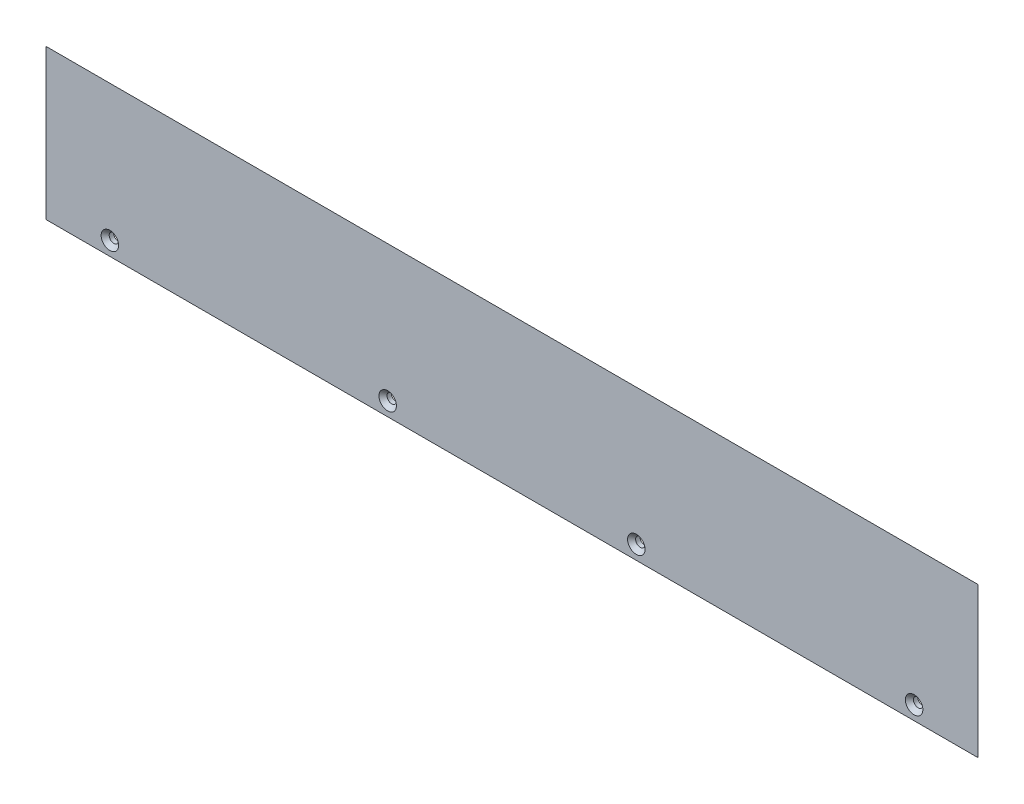
ISO-10303-21;
HEADER;
FILE_DESCRIPTION(('STEP AP214'),'2;1');
FILE_NAME('part.step','',(''),(''),'','','');
FILE_SCHEMA(('AUTOMOTIVE_DESIGN { 1 0 10303 214 1 1 1 1 }'));
ENDSEC;
DATA;
#1=APPLICATION_CONTEXT('core data for automotive mechanical design processes');
#2=APPLICATION_PROTOCOL_DEFINITION('international standard','automotive_design',2000,#1);
#3=PRODUCT_CONTEXT('',#1,'mechanical');
#4=PRODUCT('Part','Part','',(#3));
#5=PRODUCT_RELATED_PRODUCT_CATEGORY('part','',(#4));
#6=PRODUCT_DEFINITION_FORMATION('','',#4);
#7=PRODUCT_DEFINITION_CONTEXT('part definition',#1,'design');
#8=PRODUCT_DEFINITION('design','',#6,#7);
#9=PRODUCT_DEFINITION_SHAPE('','',#8);
#10=(LENGTH_UNIT() NAMED_UNIT(*) SI_UNIT(.MILLI.,.METRE.));
#11=(NAMED_UNIT(*) PLANE_ANGLE_UNIT() SI_UNIT($,.RADIAN.));
#12=(NAMED_UNIT(*) SI_UNIT($,.STERADIAN.) SOLID_ANGLE_UNIT());
#13=UNCERTAINTY_MEASURE_WITH_UNIT(LENGTH_MEASURE(1.E-05),#10,'distance_accuracy_value','');
#14=(GEOMETRIC_REPRESENTATION_CONTEXT(3) GLOBAL_UNCERTAINTY_ASSIGNED_CONTEXT((#13)) GLOBAL_UNIT_ASSIGNED_CONTEXT((#10,
#11,#12)) REPRESENTATION_CONTEXT('',''));
#15=CARTESIAN_POINT('',(0.,0.,0.));
#16=DIRECTION('',(0.,0.,1.));
#17=DIRECTION('',(1.,0.,0.));
#18=AXIS2_PLACEMENT_3D('',#15,#16,#17);
#19=CARTESIAN_POINT('',(0.,0.,3.));
#20=DIRECTION('',(0.,1.,0.));
#21=DIRECTION('',(0.,0.,1.));
#22=AXIS2_PLACEMENT_3D('',#19,#20,#21);
#23=PLANE('',#22);
#24=DIRECTION('',(1.,0.,0.));
#25=VECTOR('',#24,1.);
#26=CARTESIAN_POINT('',(0.,0.,3.));
#27=LINE('',#26,#25);
#28=CARTESIAN_POINT('',(0.,0.,3.));
#29=VERTEX_POINT('',#28);
#30=CARTESIAN_POINT('',(335.5,0.,3.));
#31=VERTEX_POINT('',#30);
#32=EDGE_CURVE('E82',#29,#31,#27,.T.);
#33=ORIENTED_EDGE('',*,*,#32,.F.);
#34=DIRECTION('',(0.707106781186548,0.,-0.707106781186548));
#35=VECTOR('',#34,1.);
#36=CARTESIAN_POINT('',(0.,0.,3.));
#37=LINE('',#36,#35);
#38=CARTESIAN_POINT('',(3.,0.,0.));
#39=VERTEX_POINT('',#38);
#40=EDGE_CURVE('E70',#29,#39,#37,.T.);
#41=ORIENTED_EDGE('',*,*,#40,.T.);
#42=DIRECTION('',(1.,0.,0.));
#43=VECTOR('',#42,1.);
#44=CARTESIAN_POINT('',(0.,0.,0.));
#45=LINE('',#44,#43);
#46=CARTESIAN_POINT('',(332.5,0.,0.));
#47=VERTEX_POINT('',#46);
#48=EDGE_CURVE('E92',#39,#47,#45,.T.);
#49=ORIENTED_EDGE('',*,*,#48,.T.);
#50=DIRECTION('',(0.707106781186548,0.,0.707106781186548));
#51=VECTOR('',#50,1.);
#52=CARTESIAN_POINT('',(335.5,0.,3.));
#53=LINE('',#52,#51);
#54=EDGE_CURVE('E79',#47,#31,#53,.T.);
#55=ORIENTED_EDGE('',*,*,#54,.T.);
#56=EDGE_LOOP('',(#33,#41,#49,#55));
#57=FACE_BOUND('',#56,.T.);
#58=ADVANCED_FACE('F32',(#57),#23,.F.);
#59=CARTESIAN_POINT('',(0.,0.,3.));
#60=DIRECTION('',(0.,0.,-1.));
#61=DIRECTION('',(-1.,0.,0.));
#62=AXIS2_PLACEMENT_3D('',#59,#60,#61);
#63=PLANE('',#62);
#64=CARTESIAN_POINT('',(23.,5.,3.));
#65=DIRECTION('',(0.,0.,1.));
#66=DIRECTION('',(1.,0.,0.));
#67=AXIS2_PLACEMENT_3D('',#64,#65,#66);
#68=CIRCLE('',#67,3.15);
#69=CARTESIAN_POINT('',(26.15,5.,3.));
#70=VERTEX_POINT('',#69);
#71=EDGE_CURVE('E140',#70,#70,#68,.T.);
#72=ORIENTED_EDGE('',*,*,#71,.F.);
#73=EDGE_LOOP('',(#72));
#74=FACE_BOUND('',#73,.T.);
#75=CARTESIAN_POINT('',(123.,5.,3.));
#76=DIRECTION('',(0.,0.,1.));
#77=DIRECTION('',(1.,0.,0.));
#78=AXIS2_PLACEMENT_3D('',#75,#76,#77);
#79=CIRCLE('',#78,3.14999999999999);
#80=CARTESIAN_POINT('',(126.15,5.,3.));
#81=VERTEX_POINT('',#80);
#82=EDGE_CURVE('E131',#81,#81,#79,.T.);
#83=ORIENTED_EDGE('',*,*,#82,.F.);
#84=EDGE_LOOP('',(#83));
#85=FACE_BOUND('',#84,.T.);
#86=CARTESIAN_POINT('',(212.5,5.,3.));
#87=DIRECTION('',(0.,0.,1.));
#88=DIRECTION('',(1.,0.,0.));
#89=AXIS2_PLACEMENT_3D('',#86,#87,#88);
#90=CIRCLE('',#89,3.15000000000001);
#91=CARTESIAN_POINT('',(215.65,5.,3.));
#92=VERTEX_POINT('',#91);
#93=EDGE_CURVE('E122',#92,#92,#90,.T.);
#94=ORIENTED_EDGE('',*,*,#93,.F.);
#95=EDGE_LOOP('',(#94));
#96=FACE_BOUND('',#95,.T.);
#97=CARTESIAN_POINT('',(312.5,5.,3.));
#98=DIRECTION('',(0.,0.,1.));
#99=DIRECTION('',(1.,0.,0.));
#100=AXIS2_PLACEMENT_3D('',#97,#98,#99);
#101=CIRCLE('',#100,3.14999999999999);
#102=CARTESIAN_POINT('',(315.65,5.,3.));
#103=VERTEX_POINT('',#102);
#104=EDGE_CURVE('E110',#103,#103,#101,.T.);
#105=ORIENTED_EDGE('',*,*,#104,.F.);
#106=EDGE_LOOP('',(#105));
#107=FACE_BOUND('',#106,.T.);
#108=DIRECTION('',(0.,-1.,0.));
#109=VECTOR('',#108,1.);
#110=CARTESIAN_POINT('',(0.,0.,3.));
#111=LINE('',#110,#109);
#112=CARTESIAN_POINT('',(0.,54.,3.));
#113=VERTEX_POINT('',#112);
#114=EDGE_CURVE('E75',#113,#29,#111,.T.);
#115=ORIENTED_EDGE('',*,*,#114,.T.);
#116=ORIENTED_EDGE('',*,*,#32,.T.);
#117=DIRECTION('',(0.,1.,0.));
#118=VECTOR('',#117,1.);
#119=CARTESIAN_POINT('',(335.5,0.,3.));
#120=LINE('',#119,#118);
#121=CARTESIAN_POINT('',(335.5,54.,3.));
#122=VERTEX_POINT('',#121);
#123=EDGE_CURVE('E86',#31,#122,#120,.T.);
#124=ORIENTED_EDGE('',*,*,#123,.T.);
#125=DIRECTION('',(-1.,0.,0.));
#126=VECTOR('',#125,1.);
#127=CARTESIAN_POINT('',(0.,54.,3.));
#128=LINE('',#127,#126);
#129=EDGE_CURVE('E90',#122,#113,#128,.T.);
#130=ORIENTED_EDGE('',*,*,#129,.T.);
#131=EDGE_LOOP('',(#115,#116,#124,#130));
#132=FACE_BOUND('',#131,.T.);
#133=ADVANCED_FACE('F88',(#74,#85,#96,#107,#132),#63,.F.);
#134=CARTESIAN_POINT('',(0.,0.,0.));
#135=DIRECTION('',(0.,0.,-1.));
#136=DIRECTION('',(-1.,0.,0.));
#137=AXIS2_PLACEMENT_3D('',#134,#135,#136);
#138=PLANE('',#137);
#139=CARTESIAN_POINT('',(23.,5.,0.));
#140=DIRECTION('',(0.,0.,1.));
#141=DIRECTION('',(1.,0.,0.));
#142=AXIS2_PLACEMENT_3D('',#139,#140,#141);
#143=CIRCLE('',#142,1.69999999999999);
#144=CARTESIAN_POINT('',(24.7,5.,0.));
#145=VERTEX_POINT('',#144);
#146=EDGE_CURVE('E134',#145,#145,#143,.T.);
#147=ORIENTED_EDGE('',*,*,#146,.T.);
#148=EDGE_LOOP('',(#147));
#149=FACE_BOUND('',#148,.T.);
#150=CARTESIAN_POINT('',(123.,5.,0.));
#151=DIRECTION('',(0.,0.,1.));
#152=DIRECTION('',(1.,0.,0.));
#153=AXIS2_PLACEMENT_3D('',#150,#151,#152);
#154=CIRCLE('',#153,1.69999999999999);
#155=CARTESIAN_POINT('',(124.7,5.,0.));
#156=VERTEX_POINT('',#155);
#157=EDGE_CURVE('E125',#156,#156,#154,.T.);
#158=ORIENTED_EDGE('',*,*,#157,.T.);
#159=EDGE_LOOP('',(#158));
#160=FACE_BOUND('',#159,.T.);
#161=CARTESIAN_POINT('',(212.5,5.,0.));
#162=DIRECTION('',(0.,0.,1.));
#163=DIRECTION('',(1.,0.,0.));
#164=AXIS2_PLACEMENT_3D('',#161,#162,#163);
#165=CIRCLE('',#164,1.69999999999998);
#166=CARTESIAN_POINT('',(214.2,5.,0.));
#167=VERTEX_POINT('',#166);
#168=EDGE_CURVE('E114',#167,#167,#165,.T.);
#169=ORIENTED_EDGE('',*,*,#168,.T.);
#170=EDGE_LOOP('',(#169));
#171=FACE_BOUND('',#170,.T.);
#172=CARTESIAN_POINT('',(312.5,5.,0.));
#173=DIRECTION('',(0.,0.,1.));
#174=DIRECTION('',(1.,0.,0.));
#175=AXIS2_PLACEMENT_3D('',#172,#173,#174);
#176=CIRCLE('',#175,1.69999999999998);
#177=CARTESIAN_POINT('',(314.2,5.,0.));
#178=VERTEX_POINT('',#177);
#179=EDGE_CURVE('E96',#178,#178,#176,.T.);
#180=ORIENTED_EDGE('',*,*,#179,.T.);
#181=EDGE_LOOP('',(#180));
#182=FACE_BOUND('',#181,.T.);
#183=ORIENTED_EDGE('',*,*,#48,.F.);
#184=DIRECTION('',(0.,1.,0.));
#185=VECTOR('',#184,1.);
#186=CARTESIAN_POINT('',(3.,54.,0.));
#187=LINE('',#186,#185);
#188=CARTESIAN_POINT('',(3.,51.,0.));
#189=VERTEX_POINT('',#188);
#190=EDGE_CURVE('E11',#39,#189,#187,.T.);
#191=ORIENTED_EDGE('',*,*,#190,.T.);
#192=DIRECTION('',(1.,0.,0.));
#193=VECTOR('',#192,1.);
#194=CARTESIAN_POINT('',(335.5,51.,0.));
#195=LINE('',#194,#193);
#196=CARTESIAN_POINT('',(332.5,51.,0.));
#197=VERTEX_POINT('',#196);
#198=EDGE_CURVE('E41',#189,#197,#195,.T.);
#199=ORIENTED_EDGE('',*,*,#198,.T.);
#200=DIRECTION('',(0.,-1.,0.));
#201=VECTOR('',#200,1.);
#202=CARTESIAN_POINT('',(332.5,0.,0.));
#203=LINE('',#202,#201);
#204=EDGE_CURVE('E78',#197,#47,#203,.T.);
#205=ORIENTED_EDGE('',*,*,#204,.T.);
#206=EDGE_LOOP('',(#183,#191,#199,#205));
#207=FACE_BOUND('',#206,.T.);
#208=ADVANCED_FACE('F148',(#149,#160,#171,#182,#207),#138,.T.);
#209=CARTESIAN_POINT('',(335.5,0.,3.));
#210=DIRECTION('',(0.707106781186547,0.,-0.707106781186547));
#211=DIRECTION('',(0.,-1.,0.));
#212=AXIS2_PLACEMENT_3D('',#209,#210,#211);
#213=PLANE('',#212);
#214=ORIENTED_EDGE('',*,*,#54,.F.);
#215=ORIENTED_EDGE('',*,*,#204,.F.);
#216=DIRECTION('',(0.577350269189626,0.577350269189626,0.577350269189626));
#217=VECTOR('',#216,1.);
#218=CARTESIAN_POINT('',(317.5,36.,-15.));
#219=LINE('',#218,#217);
#220=EDGE_CURVE('E36',#122,#197,#219,.F.);
#221=ORIENTED_EDGE('',*,*,#220,.F.);
#222=ORIENTED_EDGE('',*,*,#123,.F.);
#223=EDGE_LOOP('',(#214,#215,#221,#222));
#224=FACE_BOUND('',#223,.T.);
#225=ADVANCED_FACE('F34',(#224),#213,.T.);
#226=CARTESIAN_POINT('',(0.,54.,3.));
#227=DIRECTION('',(0.,0.707106781186547,-0.707106781186547));
#228=DIRECTION('',(1.,0.,0.));
#229=AXIS2_PLACEMENT_3D('',#226,#227,#228);
#230=PLANE('',#229);
#231=ORIENTED_EDGE('',*,*,#220,.T.);
#232=ORIENTED_EDGE('',*,*,#198,.F.);
#233=DIRECTION('',(-0.577350269189626,0.577350269189626,0.577350269189626));
#234=VECTOR('',#233,1.);
#235=CARTESIAN_POINT('',(0.,54.,3.));
#236=LINE('',#235,#234);
#237=EDGE_CURVE('E103',#113,#189,#236,.F.);
#238=ORIENTED_EDGE('',*,*,#237,.F.);
#239=ORIENTED_EDGE('',*,*,#129,.F.);
#240=EDGE_LOOP('',(#231,#232,#238,#239));
#241=FACE_BOUND('',#240,.T.);
#242=ADVANCED_FACE('F178',(#241),#230,.T.);
#243=CARTESIAN_POINT('',(0.,0.,3.));
#244=DIRECTION('',(-0.707106781186547,0.,-0.707106781186547));
#245=DIRECTION('',(0.,1.,0.));
#246=AXIS2_PLACEMENT_3D('',#243,#244,#245);
#247=PLANE('',#246);
#248=ORIENTED_EDGE('',*,*,#237,.T.);
#249=ORIENTED_EDGE('',*,*,#190,.F.);
#250=ORIENTED_EDGE('',*,*,#40,.F.);
#251=ORIENTED_EDGE('',*,*,#114,.F.);
#252=EDGE_LOOP('',(#248,#249,#250,#251));
#253=FACE_BOUND('',#252,.T.);
#254=ADVANCED_FACE('F73',(#253),#247,.T.);
#255=CARTESIAN_POINT('',(312.5,5.,3.));
#256=DIRECTION('',(0.,0.,1.));
#257=DIRECTION('',(1.,0.,0.));
#258=AXIS2_PLACEMENT_3D('',#255,#256,#257);
#259=CYLINDRICAL_SURFACE('',#258,1.69999999999998);
#260=ORIENTED_EDGE('',*,*,#179,.F.);
#261=EDGE_LOOP('',(#260));
#262=FACE_BOUND('',#261,.T.);
#263=CARTESIAN_POINT('',(312.5,5.,1.55));
#264=DIRECTION('',(0.,0.,1.));
#265=DIRECTION('',(1.,0.,0.));
#266=AXIS2_PLACEMENT_3D('',#263,#264,#265);
#267=CIRCLE('',#266,1.69999999999998);
#268=CARTESIAN_POINT('',(314.2,5.,1.55));
#269=VERTEX_POINT('',#268);
#270=EDGE_CURVE('E106',#269,#269,#267,.T.);
#271=ORIENTED_EDGE('',*,*,#270,.T.);
#272=EDGE_LOOP('',(#271));
#273=FACE_BOUND('',#272,.T.);
#274=ADVANCED_FACE('F159',(#262,#273),#259,.F.);
#275=CARTESIAN_POINT('',(312.5,5.,3.));
#276=DIRECTION('',(0.,0.,1.));
#277=DIRECTION('',(1.,0.,0.));
#278=AXIS2_PLACEMENT_3D('',#275,#276,#277);
#279=CONICAL_SURFACE('',#278,3.14999999999999,0.78539816339745);
#280=ORIENTED_EDGE('',*,*,#270,.F.);
#281=EDGE_LOOP('',(#280));
#282=FACE_BOUND('',#281,.T.);
#283=ORIENTED_EDGE('',*,*,#104,.T.);
#284=EDGE_LOOP('',(#283));
#285=FACE_BOUND('',#284,.T.);
#286=ADVANCED_FACE('F156',(#282,#285),#279,.F.);
#287=CARTESIAN_POINT('',(212.5,5.,3.));
#288=DIRECTION('',(0.,0.,1.));
#289=DIRECTION('',(1.,0.,0.));
#290=AXIS2_PLACEMENT_3D('',#287,#288,#289);
#291=CYLINDRICAL_SURFACE('',#290,1.69999999999999);
#292=ORIENTED_EDGE('',*,*,#168,.F.);
#293=EDGE_LOOP('',(#292));
#294=FACE_BOUND('',#293,.T.);
#295=CARTESIAN_POINT('',(212.5,5.,1.55));
#296=DIRECTION('',(0.,0.,1.));
#297=DIRECTION('',(1.,0.,0.));
#298=AXIS2_PLACEMENT_3D('',#295,#296,#297);
#299=CIRCLE('',#298,1.70000000000001);
#300=CARTESIAN_POINT('',(214.2,5.,1.55));
#301=VERTEX_POINT('',#300);
#302=EDGE_CURVE('E119',#301,#301,#299,.T.);
#303=ORIENTED_EDGE('',*,*,#302,.T.);
#304=EDGE_LOOP('',(#303));
#305=FACE_BOUND('',#304,.T.);
#306=ADVANCED_FACE('F158',(#294,#305),#291,.F.);
#307=CARTESIAN_POINT('',(212.5,5.,3.));
#308=DIRECTION('',(0.,0.,1.));
#309=DIRECTION('',(1.,0.,0.));
#310=AXIS2_PLACEMENT_3D('',#307,#308,#309);
#311=CONICAL_SURFACE('',#310,3.15000000000001,0.78539816339745);
#312=ORIENTED_EDGE('',*,*,#302,.F.);
#313=EDGE_LOOP('',(#312));
#314=FACE_BOUND('',#313,.T.);
#315=ORIENTED_EDGE('',*,*,#93,.T.);
#316=EDGE_LOOP('',(#315));
#317=FACE_BOUND('',#316,.T.);
#318=ADVANCED_FACE('F166',(#314,#317),#311,.F.);
#319=CARTESIAN_POINT('',(123.,5.,3.));
#320=DIRECTION('',(0.,0.,1.));
#321=DIRECTION('',(1.,0.,0.));
#322=AXIS2_PLACEMENT_3D('',#319,#320,#321);
#323=CYLINDRICAL_SURFACE('',#322,1.69999999999999);
#324=ORIENTED_EDGE('',*,*,#157,.F.);
#325=EDGE_LOOP('',(#324));
#326=FACE_BOUND('',#325,.T.);
#327=CARTESIAN_POINT('',(123.,5.,1.55));
#328=DIRECTION('',(0.,0.,1.));
#329=DIRECTION('',(1.,0.,0.));
#330=AXIS2_PLACEMENT_3D('',#327,#328,#329);
#331=CIRCLE('',#330,1.69999999999999);
#332=CARTESIAN_POINT('',(124.7,5.,1.55));
#333=VERTEX_POINT('',#332);
#334=EDGE_CURVE('E128',#333,#333,#331,.T.);
#335=ORIENTED_EDGE('',*,*,#334,.T.);
#336=EDGE_LOOP('',(#335));
#337=FACE_BOUND('',#336,.T.);
#338=ADVANCED_FACE('F200',(#326,#337),#323,.F.);
#339=CARTESIAN_POINT('',(123.,5.,3.));
#340=DIRECTION('',(0.,0.,1.));
#341=DIRECTION('',(1.,0.,0.));
#342=AXIS2_PLACEMENT_3D('',#339,#340,#341);
#343=CONICAL_SURFACE('',#342,3.14999999999999,0.785398163397446);
#344=ORIENTED_EDGE('',*,*,#334,.F.);
#345=EDGE_LOOP('',(#344));
#346=FACE_BOUND('',#345,.T.);
#347=ORIENTED_EDGE('',*,*,#82,.T.);
#348=EDGE_LOOP('',(#347));
#349=FACE_BOUND('',#348,.T.);
#350=ADVANCED_FACE('F205',(#346,#349),#343,.F.);
#351=CARTESIAN_POINT('',(23.,5.,3.));
#352=DIRECTION('',(0.,0.,1.));
#353=DIRECTION('',(1.,0.,0.));
#354=AXIS2_PLACEMENT_3D('',#351,#352,#353);
#355=CYLINDRICAL_SURFACE('',#354,1.69999999999999);
#356=ORIENTED_EDGE('',*,*,#146,.F.);
#357=EDGE_LOOP('',(#356));
#358=FACE_BOUND('',#357,.T.);
#359=CARTESIAN_POINT('',(23.,5.,1.55));
#360=DIRECTION('',(0.,0.,1.));
#361=DIRECTION('',(1.,0.,0.));
#362=AXIS2_PLACEMENT_3D('',#359,#360,#361);
#363=CIRCLE('',#362,1.7);
#364=CARTESIAN_POINT('',(24.7,5.,1.55));
#365=VERTEX_POINT('',#364);
#366=EDGE_CURVE('E137',#365,#365,#363,.T.);
#367=ORIENTED_EDGE('',*,*,#366,.T.);
#368=EDGE_LOOP('',(#367));
#369=FACE_BOUND('',#368,.T.);
#370=ADVANCED_FACE('F211',(#358,#369),#355,.F.);
#371=CARTESIAN_POINT('',(23.,5.,3.));
#372=DIRECTION('',(0.,0.,1.));
#373=DIRECTION('',(1.,0.,0.));
#374=AXIS2_PLACEMENT_3D('',#371,#372,#373);
#375=CONICAL_SURFACE('',#374,3.15,0.785398163397448);
#376=ORIENTED_EDGE('',*,*,#366,.F.);
#377=EDGE_LOOP('',(#376));
#378=FACE_BOUND('',#377,.T.);
#379=ORIENTED_EDGE('',*,*,#71,.T.);
#380=EDGE_LOOP('',(#379));
#381=FACE_BOUND('',#380,.T.);
#382=ADVANCED_FACE('F144',(#378,#381),#375,.F.);
#383=CLOSED_SHELL('',(#58,#133,#208,#225,#242,#254,#274,#286,#306,#318,#338,#350,#370,#382));
#384=MANIFOLD_SOLID_BREP('B2',#383);
#385=ADVANCED_BREP_SHAPE_REPRESENTATION('',(#18,#384),#14);
#386=SHAPE_DEFINITION_REPRESENTATION(#9,#385);
ENDSEC;
END-ISO-10303-21;
